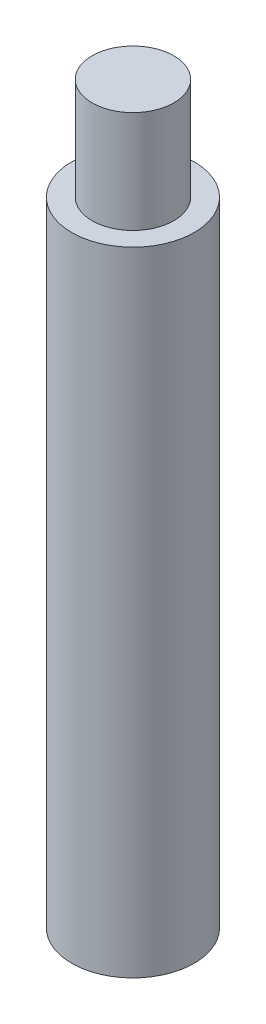
ISO-10303-21;
HEADER;
FILE_DESCRIPTION(('STEP AP214'),'2;1');
FILE_NAME('part.step','',(''),(''),'','','');
FILE_SCHEMA(('AUTOMOTIVE_DESIGN { 1 0 10303 214 1 1 1 1 }'));
ENDSEC;
DATA;
#1=APPLICATION_CONTEXT('core data for automotive mechanical design processes');
#2=APPLICATION_PROTOCOL_DEFINITION('international standard','automotive_design',2000,#1);
#3=PRODUCT_CONTEXT('',#1,'mechanical');
#4=PRODUCT('Part','Part','',(#3));
#5=PRODUCT_RELATED_PRODUCT_CATEGORY('part','',(#4));
#6=PRODUCT_DEFINITION_FORMATION('','',#4);
#7=PRODUCT_DEFINITION_CONTEXT('part definition',#1,'design');
#8=PRODUCT_DEFINITION('design','',#6,#7);
#9=PRODUCT_DEFINITION_SHAPE('','',#8);
#10=(LENGTH_UNIT() NAMED_UNIT(*) SI_UNIT(.MILLI.,.METRE.));
#11=(NAMED_UNIT(*) PLANE_ANGLE_UNIT() SI_UNIT($,.RADIAN.));
#12=(NAMED_UNIT(*) SI_UNIT($,.STERADIAN.) SOLID_ANGLE_UNIT());
#13=UNCERTAINTY_MEASURE_WITH_UNIT(LENGTH_MEASURE(1.E-05),#10,'distance_accuracy_value','');
#14=(GEOMETRIC_REPRESENTATION_CONTEXT(3) GLOBAL_UNCERTAINTY_ASSIGNED_CONTEXT((#13)) GLOBAL_UNIT_ASSIGNED_CONTEXT((#10,
#11,#12)) REPRESENTATION_CONTEXT('',''));
#15=CARTESIAN_POINT('',(0.,0.,0.));
#16=DIRECTION('',(0.,0.,1.));
#17=DIRECTION('',(1.,0.,0.));
#18=AXIS2_PLACEMENT_3D('',#15,#16,#17);
#19=CARTESIAN_POINT('',(0.,0.,0.));
#20=DIRECTION('',(0.,1.,0.));
#21=DIRECTION('',(-1.,0.,0.));
#22=AXIS2_PLACEMENT_3D('',#19,#20,#21);
#23=PLANE('',#22);
#24=CARTESIAN_POINT('',(0.,0.,0.));
#25=DIRECTION('',(0.,1.,0.));
#26=DIRECTION('',(-1.,0.,0.));
#27=AXIS2_PLACEMENT_3D('',#24,#25,#26);
#28=CIRCLE('',#27,1.5);
#29=CARTESIAN_POINT('',(-1.5,0.,0.));
#30=VERTEX_POINT('',#29);
#31=EDGE_CURVE('E10',#30,#30,#28,.T.);
#32=ORIENTED_EDGE('',*,*,#31,.F.);
#33=EDGE_LOOP('',(#32));
#34=FACE_BOUND('',#33,.T.);
#35=ADVANCED_FACE('F34',(#34),#23,.F.);
#36=CARTESIAN_POINT('',(0.,18.,0.));
#37=DIRECTION('',(0.,1.,0.));
#38=DIRECTION('',(-1.,0.,0.));
#39=AXIS2_PLACEMENT_3D('',#36,#37,#38);
#40=CYLINDRICAL_SURFACE('',#39,1.5);
#41=CARTESIAN_POINT('',(0.,15.5,0.));
#42=DIRECTION('',(0.,1.,0.));
#43=DIRECTION('',(-1.,0.,0.));
#44=AXIS2_PLACEMENT_3D('',#41,#42,#43);
#45=CIRCLE('',#44,1.5);
#46=CARTESIAN_POINT('',(-1.5,15.5,0.));
#47=VERTEX_POINT('',#46);
#48=EDGE_CURVE('E40',#47,#47,#45,.T.);
#49=ORIENTED_EDGE('',*,*,#48,.F.);
#50=EDGE_LOOP('',(#49));
#51=FACE_BOUND('',#50,.T.);
#52=ORIENTED_EDGE('',*,*,#31,.T.);
#53=EDGE_LOOP('',(#52));
#54=FACE_BOUND('',#53,.T.);
#55=ADVANCED_FACE('F64',(#51,#54),#40,.T.);
#56=CARTESIAN_POINT('',(1.5,15.5,0.));
#57=DIRECTION('',(0.,-1.,0.));
#58=DIRECTION('',(1.,0.,0.));
#59=AXIS2_PLACEMENT_3D('',#56,#57,#58);
#60=PLANE('',#59);
#61=CARTESIAN_POINT('',(0.,15.5,0.));
#62=DIRECTION('',(0.,1.,0.));
#63=DIRECTION('',(-1.,0.,0.));
#64=AXIS2_PLACEMENT_3D('',#61,#62,#63);
#65=CIRCLE('',#64,1.);
#66=CARTESIAN_POINT('',(-1.,15.5,0.));
#67=VERTEX_POINT('',#66);
#68=EDGE_CURVE('E44',#67,#67,#65,.T.);
#69=ORIENTED_EDGE('',*,*,#68,.F.);
#70=EDGE_LOOP('',(#69));
#71=FACE_BOUND('',#70,.T.);
#72=ORIENTED_EDGE('',*,*,#48,.T.);
#73=EDGE_LOOP('',(#72));
#74=FACE_BOUND('',#73,.T.);
#75=ADVANCED_FACE('F59',(#71,#74),#60,.F.);
#76=CARTESIAN_POINT('',(0.,18.,0.));
#77=DIRECTION('',(0.,1.,0.));
#78=DIRECTION('',(-1.,0.,0.));
#79=AXIS2_PLACEMENT_3D('',#76,#77,#78);
#80=CYLINDRICAL_SURFACE('',#79,1.);
#81=CARTESIAN_POINT('',(0.,18.,0.));
#82=DIRECTION('',(0.,1.,0.));
#83=DIRECTION('',(-1.,0.,0.));
#84=AXIS2_PLACEMENT_3D('',#81,#82,#83);
#85=CIRCLE('',#84,1.);
#86=CARTESIAN_POINT('',(-1.,18.,0.));
#87=VERTEX_POINT('',#86);
#88=EDGE_CURVE('E48',#87,#87,#85,.T.);
#89=ORIENTED_EDGE('',*,*,#88,.F.);
#90=EDGE_LOOP('',(#89));
#91=FACE_BOUND('',#90,.T.);
#92=ORIENTED_EDGE('',*,*,#68,.T.);
#93=EDGE_LOOP('',(#92));
#94=FACE_BOUND('',#93,.T.);
#95=ADVANCED_FACE('F56',(#91,#94),#80,.T.);
#96=CARTESIAN_POINT('',(1.,18.,0.));
#97=DIRECTION('',(0.,-1.,0.));
#98=DIRECTION('',(1.,0.,0.));
#99=AXIS2_PLACEMENT_3D('',#96,#97,#98);
#100=PLANE('',#99);
#101=ORIENTED_EDGE('',*,*,#88,.T.);
#102=EDGE_LOOP('',(#101));
#103=FACE_BOUND('',#102,.T.);
#104=ADVANCED_FACE('F54',(#103),#100,.F.);
#105=CLOSED_SHELL('',(#35,#55,#75,#95,#104));
#106=MANIFOLD_SOLID_BREP('B2',#105);
#107=ADVANCED_BREP_SHAPE_REPRESENTATION('',(#18,#106),#14);
#108=SHAPE_DEFINITION_REPRESENTATION(#9,#107);
ENDSEC;
END-ISO-10303-21;
